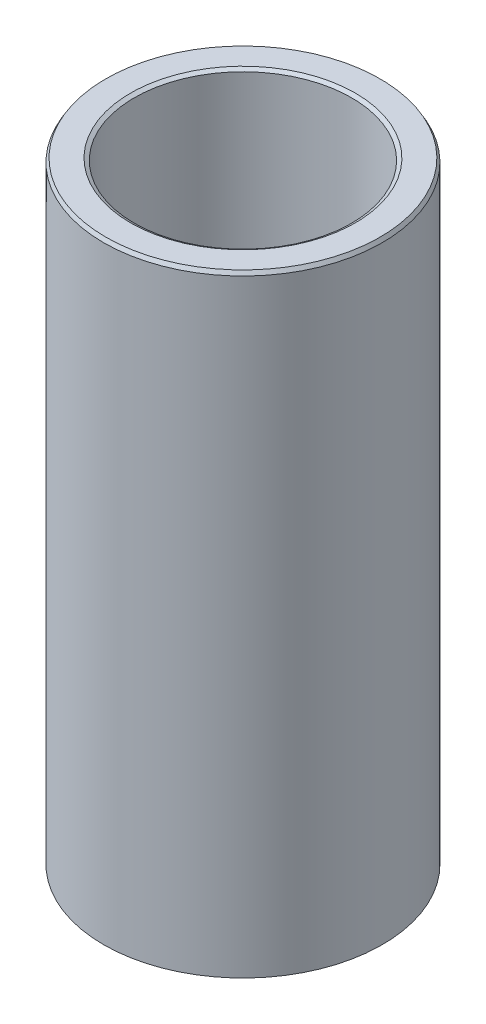
ISO-10303-21;
HEADER;
FILE_DESCRIPTION(('STEP AP214'),'2;1');
FILE_NAME('part.step','',(''),(''),'','','');
FILE_SCHEMA(('AUTOMOTIVE_DESIGN { 1 0 10303 214 1 1 1 1 }'));
ENDSEC;
DATA;
#1=APPLICATION_CONTEXT('core data for automotive mechanical design processes');
#2=APPLICATION_PROTOCOL_DEFINITION('international standard','automotive_design',2000,#1);
#3=PRODUCT_CONTEXT('',#1,'mechanical');
#4=PRODUCT('Part','Part','',(#3));
#5=PRODUCT_RELATED_PRODUCT_CATEGORY('part','',(#4));
#6=PRODUCT_DEFINITION_FORMATION('','',#4);
#7=PRODUCT_DEFINITION_CONTEXT('part definition',#1,'design');
#8=PRODUCT_DEFINITION('design','',#6,#7);
#9=PRODUCT_DEFINITION_SHAPE('','',#8);
#10=(LENGTH_UNIT() NAMED_UNIT(*) SI_UNIT(.MILLI.,.METRE.));
#11=(NAMED_UNIT(*) PLANE_ANGLE_UNIT() SI_UNIT($,.RADIAN.));
#12=(NAMED_UNIT(*) SI_UNIT($,.STERADIAN.) SOLID_ANGLE_UNIT());
#13=UNCERTAINTY_MEASURE_WITH_UNIT(LENGTH_MEASURE(1.E-05),#10,'distance_accuracy_value','');
#14=(GEOMETRIC_REPRESENTATION_CONTEXT(3) GLOBAL_UNCERTAINTY_ASSIGNED_CONTEXT((#13)) GLOBAL_UNIT_ASSIGNED_CONTEXT((#10,
#11,#12)) REPRESENTATION_CONTEXT('',''));
#15=CARTESIAN_POINT('',(0.,0.,0.));
#16=DIRECTION('',(0.,0.,1.));
#17=DIRECTION('',(1.,0.,0.));
#18=AXIS2_PLACEMENT_3D('',#15,#16,#17);
#19=CARTESIAN_POINT('',(0.,264.404737894527,0.));
#20=DIRECTION('',(0.,-1.,0.));
#21=DIRECTION('',(0.,0.,-1.));
#22=AXIS2_PLACEMENT_3D('',#19,#20,#21);
#23=CYLINDRICAL_SURFACE('',#22,60.);
#24=CARTESIAN_POINT('',(0.,0.932035575079537,0.));
#25=DIRECTION('',(0.,1.,0.));
#26=DIRECTION('',(0.,0.,1.));
#27=AXIS2_PLACEMENT_3D('',#24,#25,#26);
#28=CIRCLE('',#27,60.);
#29=CARTESIAN_POINT('',(0.,0.932035575079537,60.));
#30=VERTEX_POINT('',#29);
#31=EDGE_CURVE('E10',#30,#30,#28,.T.);
#32=ORIENTED_EDGE('',*,*,#31,.T.);
#33=EDGE_LOOP('',(#32));
#34=FACE_BOUND('',#33,.T.);
#35=CARTESIAN_POINT('',(0.,262.790404924028,0.));
#36=DIRECTION('',(0.,1.,0.));
#37=DIRECTION('',(0.,0.,1.));
#38=AXIS2_PLACEMENT_3D('',#35,#36,#37);
#39=CIRCLE('',#38,60.);
#40=CARTESIAN_POINT('',(0.,262.790404924028,60.));
#41=VERTEX_POINT('',#40);
#42=EDGE_CURVE('E50',#41,#41,#39,.F.);
#43=ORIENTED_EDGE('',*,*,#42,.T.);
#44=EDGE_LOOP('',(#43));
#45=FACE_BOUND('',#44,.T.);
#46=ADVANCED_FACE('F39',(#34,#45),#23,.T.);
#47=CARTESIAN_POINT('',(0.,264.404737894527,0.));
#48=DIRECTION('',(0.,1.,0.));
#49=DIRECTION('',(0.,0.,1.));
#50=AXIS2_PLACEMENT_3D('',#47,#48,#49);
#51=PLANE('',#50);
#52=CARTESIAN_POINT('',(0.,264.404737894527,0.));
#53=DIRECTION('',(0.,1.,0.));
#54=DIRECTION('',(0.,0.,1.));
#55=AXIS2_PLACEMENT_3D('',#52,#53,#54);
#56=CIRCLE('',#55,48.419730706283);
#57=CARTESIAN_POINT('',(0.,264.404737894527,48.419730706283));
#58=VERTEX_POINT('',#57);
#59=EDGE_CURVE('E58',#58,#58,#56,.F.);
#60=ORIENTED_EDGE('',*,*,#59,.T.);
#61=EDGE_LOOP('',(#60));
#62=FACE_BOUND('',#61,.T.);
#63=CARTESIAN_POINT('',(0.,264.404737894527,0.));
#64=DIRECTION('',(0.,1.,0.));
#65=DIRECTION('',(0.,0.,1.));
#66=AXIS2_PLACEMENT_3D('',#63,#64,#65);
#67=CIRCLE('',#66,59.0679644249204);
#68=CARTESIAN_POINT('',(0.,264.404737894527,59.0679644249204));
#69=VERTEX_POINT('',#68);
#70=EDGE_CURVE('E61',#69,#69,#67,.T.);
#71=ORIENTED_EDGE('',*,*,#70,.T.);
#72=EDGE_LOOP('',(#71));
#73=FACE_BOUND('',#72,.T.);
#74=ADVANCED_FACE('F88',(#62,#73),#51,.T.);
#75=CARTESIAN_POINT('',(0.,0.,0.));
#76=DIRECTION('',(0.,1.,0.));
#77=DIRECTION('',(0.,0.,1.));
#78=AXIS2_PLACEMENT_3D('',#75,#76,#77);
#79=PLANE('',#78);
#80=CARTESIAN_POINT('',(0.,0.,0.));
#81=DIRECTION('',(0.,1.,0.));
#82=DIRECTION('',(0.,0.,1.));
#83=AXIS2_PLACEMENT_3D('',#80,#81,#82);
#84=CIRCLE('',#83,47.7374333108631);
#85=CARTESIAN_POINT('',(0.,0.,47.7374333108631));
#86=VERTEX_POINT('',#85);
#87=EDGE_CURVE('E51',#86,#86,#84,.T.);
#88=ORIENTED_EDGE('',*,*,#87,.T.);
#89=EDGE_LOOP('',(#88));
#90=FACE_BOUND('',#89,.T.);
#91=CARTESIAN_POINT('',(0.,0.,0.));
#92=DIRECTION('',(0.,1.,0.));
#93=DIRECTION('',(0.,0.,1.));
#94=AXIS2_PLACEMENT_3D('',#91,#92,#93);
#95=CIRCLE('',#94,58.3856670295006);
#96=CARTESIAN_POINT('',(0.,0.,58.3856670295006));
#97=VERTEX_POINT('',#96);
#98=EDGE_CURVE('E54',#97,#97,#95,.F.);
#99=ORIENTED_EDGE('',*,*,#98,.T.);
#100=EDGE_LOOP('',(#99));
#101=FACE_BOUND('',#100,.T.);
#102=ADVANCED_FACE('F83',(#90,#101),#79,.F.);
#103=CARTESIAN_POINT('',(0.,264.404737894527,0.));
#104=DIRECTION('',(0.,-1.,0.));
#105=DIRECTION('',(0.,0.,-1.));
#106=AXIS2_PLACEMENT_3D('',#103,#104,#105);
#107=CYLINDRICAL_SURFACE('',#106,46.8053977357836);
#108=CARTESIAN_POINT('',(0.,263.472702319448,0.));
#109=DIRECTION('',(0.,1.,0.));
#110=DIRECTION('',(0.,0.,1.));
#111=AXIS2_PLACEMENT_3D('',#108,#109,#110);
#112=CIRCLE('',#111,46.8053977357836);
#113=CARTESIAN_POINT('',(0.,263.472702319448,46.8053977357836));
#114=VERTEX_POINT('',#113);
#115=EDGE_CURVE('E67',#114,#114,#112,.T.);
#116=ORIENTED_EDGE('',*,*,#115,.T.);
#117=EDGE_LOOP('',(#116));
#118=FACE_BOUND('',#117,.T.);
#119=CARTESIAN_POINT('',(0.,1.6143329704994,0.));
#120=DIRECTION('',(0.,1.,0.));
#121=DIRECTION('',(0.,0.,1.));
#122=AXIS2_PLACEMENT_3D('',#119,#120,#121);
#123=CIRCLE('',#122,46.8053977357836);
#124=CARTESIAN_POINT('',(0.,1.6143329704994,46.8053977357836));
#125=VERTEX_POINT('',#124);
#126=EDGE_CURVE('E69',#125,#125,#123,.F.);
#127=ORIENTED_EDGE('',*,*,#126,.T.);
#128=EDGE_LOOP('',(#127));
#129=FACE_BOUND('',#128,.T.);
#130=ADVANCED_FACE('F71',(#118,#129),#107,.F.);
#131=CARTESIAN_POINT('',(0.,263.472702319448,0.));
#132=DIRECTION('',(0.,1.,0.));
#133=DIRECTION('',(0.,0.,1.));
#134=AXIS2_PLACEMENT_3D('',#131,#132,#133);
#135=CONICAL_SURFACE('',#134,46.8053977357836,1.0471975511966);
#136=ORIENTED_EDGE('',*,*,#59,.F.);
#137=EDGE_LOOP('',(#136));
#138=FACE_BOUND('',#137,.T.);
#139=ORIENTED_EDGE('',*,*,#115,.F.);
#140=EDGE_LOOP('',(#139));
#141=FACE_BOUND('',#140,.T.);
#142=ADVANCED_FACE('F77',(#138,#141),#135,.F.);
#143=CARTESIAN_POINT('',(0.,0.,0.));
#144=DIRECTION('',(0.,-1.,0.));
#145=DIRECTION('',(0.,0.,-1.));
#146=AXIS2_PLACEMENT_3D('',#143,#144,#145);
#147=CONICAL_SURFACE('',#146,47.7374333108631,0.523598775598289);
#148=ORIENTED_EDGE('',*,*,#126,.F.);
#149=EDGE_LOOP('',(#148));
#150=FACE_BOUND('',#149,.T.);
#151=ORIENTED_EDGE('',*,*,#87,.F.);
#152=EDGE_LOOP('',(#151));
#153=FACE_BOUND('',#152,.T.);
#154=ADVANCED_FACE('F73',(#150,#153),#147,.F.);
#155=CARTESIAN_POINT('',(0.,0.932035575079537,0.));
#156=DIRECTION('',(0.,1.,0.));
#157=DIRECTION('',(0.,0.,1.));
#158=AXIS2_PLACEMENT_3D('',#155,#156,#157);
#159=CONICAL_SURFACE('',#158,60.,1.0471975511966);
#160=ORIENTED_EDGE('',*,*,#98,.F.);
#161=EDGE_LOOP('',(#160));
#162=FACE_BOUND('',#161,.T.);
#163=ORIENTED_EDGE('',*,*,#31,.F.);
#164=EDGE_LOOP('',(#163));
#165=FACE_BOUND('',#164,.T.);
#166=ADVANCED_FACE('F76',(#162,#165),#159,.T.);
#167=CARTESIAN_POINT('',(0.,264.404737894527,0.));
#168=DIRECTION('',(0.,-1.,0.));
#169=DIRECTION('',(0.,0.,-1.));
#170=AXIS2_PLACEMENT_3D('',#167,#168,#169);
#171=CONICAL_SURFACE('',#170,59.0679644249204,0.523598775598292);
#172=ORIENTED_EDGE('',*,*,#42,.F.);
#173=EDGE_LOOP('',(#172));
#174=FACE_BOUND('',#173,.T.);
#175=ORIENTED_EDGE('',*,*,#70,.F.);
#176=EDGE_LOOP('',(#175));
#177=FACE_BOUND('',#176,.T.);
#178=ADVANCED_FACE('F45',(#174,#177),#171,.T.);
#179=CLOSED_SHELL('',(#46,#74,#102,#130,#142,#154,#166,#178));
#180=MANIFOLD_SOLID_BREP('B2',#179);
#181=ADVANCED_BREP_SHAPE_REPRESENTATION('',(#18,#180),#14);
#182=SHAPE_DEFINITION_REPRESENTATION(#9,#181);
ENDSEC;
END-ISO-10303-21;
